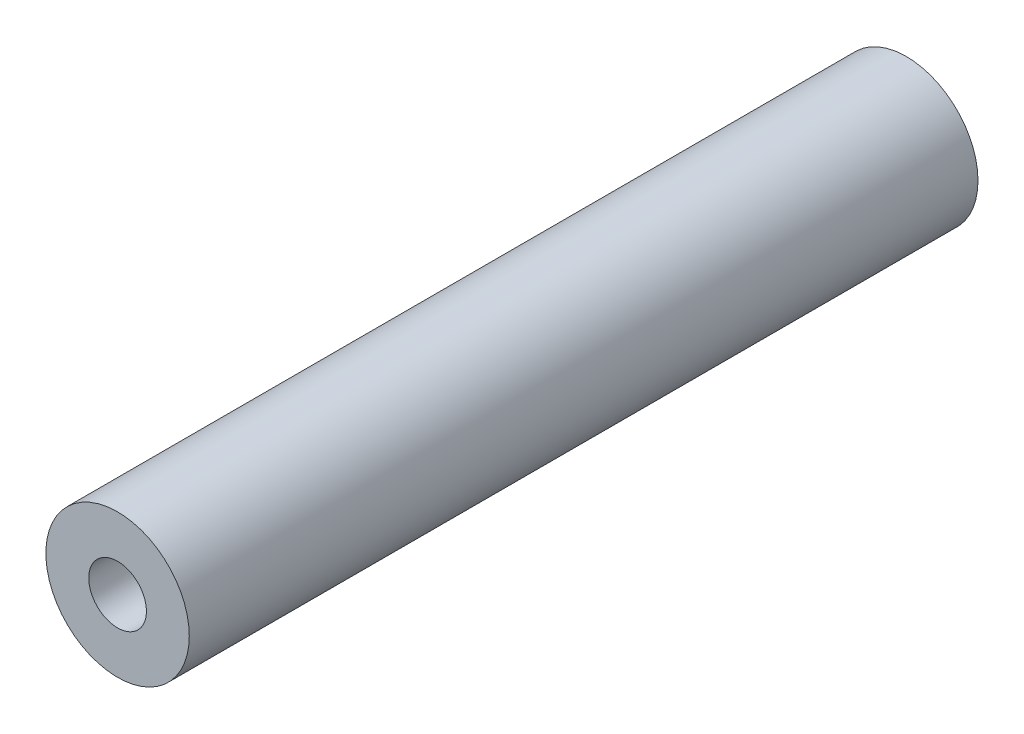
ISO-10303-21;
HEADER;
FILE_DESCRIPTION(('STEP AP214'),'2;1');
FILE_NAME('part.step','',(''),(''),'','','');
FILE_SCHEMA(('AUTOMOTIVE_DESIGN { 1 0 10303 214 1 1 1 1 }'));
ENDSEC;
DATA;
#1=APPLICATION_CONTEXT('core data for automotive mechanical design processes');
#2=APPLICATION_PROTOCOL_DEFINITION('international standard','automotive_design',2000,#1);
#3=PRODUCT_CONTEXT('',#1,'mechanical');
#4=PRODUCT('Part','Part','',(#3));
#5=PRODUCT_RELATED_PRODUCT_CATEGORY('part','',(#4));
#6=PRODUCT_DEFINITION_FORMATION('','',#4);
#7=PRODUCT_DEFINITION_CONTEXT('part definition',#1,'design');
#8=PRODUCT_DEFINITION('design','',#6,#7);
#9=PRODUCT_DEFINITION_SHAPE('','',#8);
#10=(LENGTH_UNIT() NAMED_UNIT(*) SI_UNIT(.MILLI.,.METRE.));
#11=(NAMED_UNIT(*) PLANE_ANGLE_UNIT() SI_UNIT($,.RADIAN.));
#12=(NAMED_UNIT(*) SI_UNIT($,.STERADIAN.) SOLID_ANGLE_UNIT());
#13=UNCERTAINTY_MEASURE_WITH_UNIT(LENGTH_MEASURE(1.E-05),#10,'distance_accuracy_value','');
#14=(GEOMETRIC_REPRESENTATION_CONTEXT(3) GLOBAL_UNCERTAINTY_ASSIGNED_CONTEXT((#13)) GLOBAL_UNIT_ASSIGNED_CONTEXT((#10,
#11,#12)) REPRESENTATION_CONTEXT('',''));
#15=CARTESIAN_POINT('',(0.,0.,0.));
#16=DIRECTION('',(0.,0.,1.));
#17=DIRECTION('',(1.,0.,0.));
#18=AXIS2_PLACEMENT_3D('',#15,#16,#17);
#19=CARTESIAN_POINT('',(0.,0.,110.));
#20=DIRECTION('',(0.,0.,1.));
#21=DIRECTION('',(1.,0.,0.));
#22=AXIS2_PLACEMENT_3D('',#19,#20,#21);
#23=PLANE('',#22);
#24=CARTESIAN_POINT('',(0.,0.,110.));
#25=DIRECTION('',(0.,0.,1.));
#26=DIRECTION('',(1.,0.,0.));
#27=AXIS2_PLACEMENT_3D('',#24,#25,#26);
#28=CIRCLE('',#27,10.);
#29=CARTESIAN_POINT('',(10.,0.,110.));
#30=VERTEX_POINT('',#29);
#31=EDGE_CURVE('E10',#30,#30,#28,.T.);
#32=ORIENTED_EDGE('',*,*,#31,.T.);
#33=EDGE_LOOP('',(#32));
#34=FACE_BOUND('',#33,.T.);
#35=CARTESIAN_POINT('',(0.,0.,110.));
#36=DIRECTION('',(0.,0.,1.));
#37=DIRECTION('',(1.,0.,0.));
#38=AXIS2_PLACEMENT_3D('',#35,#36,#37);
#39=CIRCLE('',#38,4.025);
#40=CARTESIAN_POINT('',(4.025,0.,110.));
#41=VERTEX_POINT('',#40);
#42=EDGE_CURVE('E42',#41,#41,#39,.T.);
#43=ORIENTED_EDGE('',*,*,#42,.F.);
#44=EDGE_LOOP('',(#43));
#45=FACE_BOUND('',#44,.T.);
#46=ADVANCED_FACE('F31',(#34,#45),#23,.T.);
#47=CARTESIAN_POINT('',(0.,0.,0.));
#48=DIRECTION('',(0.,0.,1.));
#49=DIRECTION('',(1.,0.,0.));
#50=AXIS2_PLACEMENT_3D('',#47,#48,#49);
#51=PLANE('',#50);
#52=CARTESIAN_POINT('',(0.,0.,0.));
#53=DIRECTION('',(0.,0.,1.));
#54=DIRECTION('',(1.,0.,0.));
#55=AXIS2_PLACEMENT_3D('',#52,#53,#54);
#56=CIRCLE('',#55,10.);
#57=CARTESIAN_POINT('',(10.,0.,0.));
#58=VERTEX_POINT('',#57);
#59=EDGE_CURVE('E35',#58,#58,#56,.T.);
#60=ORIENTED_EDGE('',*,*,#59,.F.);
#61=EDGE_LOOP('',(#60));
#62=FACE_BOUND('',#61,.T.);
#63=CARTESIAN_POINT('',(0.,0.,0.));
#64=DIRECTION('',(0.,0.,1.));
#65=DIRECTION('',(1.,0.,0.));
#66=AXIS2_PLACEMENT_3D('',#63,#64,#65);
#67=CIRCLE('',#66,4.025);
#68=CARTESIAN_POINT('',(4.025,0.,0.));
#69=VERTEX_POINT('',#68);
#70=EDGE_CURVE('E44',#69,#69,#67,.T.);
#71=ORIENTED_EDGE('',*,*,#70,.T.);
#72=EDGE_LOOP('',(#71));
#73=FACE_BOUND('',#72,.T.);
#74=ADVANCED_FACE('F54',(#62,#73),#51,.F.);
#75=CARTESIAN_POINT('',(0.,0.,110.));
#76=DIRECTION('',(0.,0.,-1.));
#77=DIRECTION('',(-1.,0.,0.));
#78=AXIS2_PLACEMENT_3D('',#75,#76,#77);
#79=CYLINDRICAL_SURFACE('',#78,10.);
#80=ORIENTED_EDGE('',*,*,#31,.F.);
#81=EDGE_LOOP('',(#80));
#82=FACE_BOUND('',#81,.T.);
#83=ORIENTED_EDGE('',*,*,#59,.T.);
#84=EDGE_LOOP('',(#83));
#85=FACE_BOUND('',#84,.T.);
#86=ADVANCED_FACE('F33',(#82,#85),#79,.T.);
#87=CARTESIAN_POINT('',(0.,0.,110.));
#88=DIRECTION('',(0.,0.,-1.));
#89=DIRECTION('',(-1.,0.,0.));
#90=AXIS2_PLACEMENT_3D('',#87,#88,#89);
#91=CYLINDRICAL_SURFACE('',#90,4.025);
#92=ORIENTED_EDGE('',*,*,#42,.T.);
#93=EDGE_LOOP('',(#92));
#94=FACE_BOUND('',#93,.T.);
#95=ORIENTED_EDGE('',*,*,#70,.F.);
#96=EDGE_LOOP('',(#95));
#97=FACE_BOUND('',#96,.T.);
#98=ADVANCED_FACE('F50',(#94,#97),#91,.F.);
#99=CLOSED_SHELL('',(#46,#74,#86,#98));
#100=MANIFOLD_SOLID_BREP('B2',#99);
#101=ADVANCED_BREP_SHAPE_REPRESENTATION('',(#18,#100),#14);
#102=SHAPE_DEFINITION_REPRESENTATION(#9,#101);
ENDSEC;
END-ISO-10303-21;
